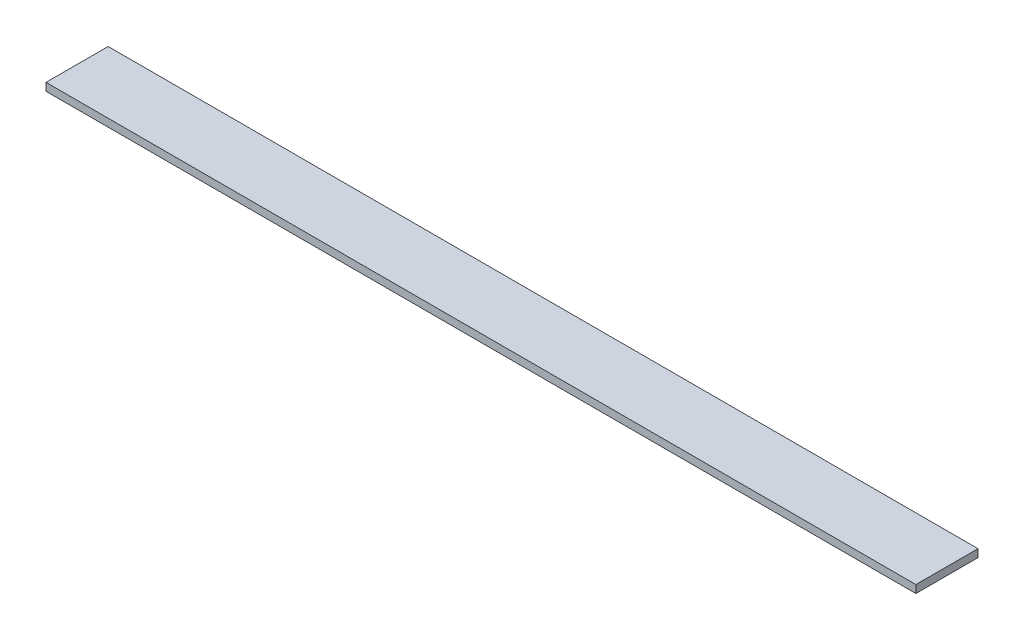
ISO-10303-21;
HEADER;
FILE_DESCRIPTION(('STEP AP214'),'2;1');
FILE_NAME('part.step','',(''),(''),'','','');
FILE_SCHEMA(('AUTOMOTIVE_DESIGN { 1 0 10303 214 1 1 1 1 }'));
ENDSEC;
DATA;
#1=APPLICATION_CONTEXT('core data for automotive mechanical design processes');
#2=APPLICATION_PROTOCOL_DEFINITION('international standard','automotive_design',2000,#1);
#3=PRODUCT_CONTEXT('',#1,'mechanical');
#4=PRODUCT('Part','Part','',(#3));
#5=PRODUCT_RELATED_PRODUCT_CATEGORY('part','',(#4));
#6=PRODUCT_DEFINITION_FORMATION('','',#4);
#7=PRODUCT_DEFINITION_CONTEXT('part definition',#1,'design');
#8=PRODUCT_DEFINITION('design','',#6,#7);
#9=PRODUCT_DEFINITION_SHAPE('','',#8);
#10=(LENGTH_UNIT() NAMED_UNIT(*) SI_UNIT(.MILLI.,.METRE.));
#11=(NAMED_UNIT(*) PLANE_ANGLE_UNIT() SI_UNIT($,.RADIAN.));
#12=(NAMED_UNIT(*) SI_UNIT($,.STERADIAN.) SOLID_ANGLE_UNIT());
#13=UNCERTAINTY_MEASURE_WITH_UNIT(LENGTH_MEASURE(1.E-05),#10,'distance_accuracy_value','');
#14=(GEOMETRIC_REPRESENTATION_CONTEXT(3) GLOBAL_UNCERTAINTY_ASSIGNED_CONTEXT((#13)) GLOBAL_UNIT_ASSIGNED_CONTEXT((#10,
#11,#12)) REPRESENTATION_CONTEXT('',''));
#15=CARTESIAN_POINT('',(0.,0.,0.));
#16=DIRECTION('',(0.,0.,1.));
#17=DIRECTION('',(1.,0.,0.));
#18=AXIS2_PLACEMENT_3D('',#15,#16,#17);
#19=CARTESIAN_POINT('',(-51.0353270365557,3.175,-21.6513508639933));
#20=DIRECTION('',(1.,0.,0.));
#21=DIRECTION('',(0.,0.,-1.));
#22=AXIS2_PLACEMENT_3D('',#19,#20,#21);
#23=PLANE('',#22);
#24=DIRECTION('',(0.,0.,1.));
#25=VECTOR('',#24,1.);
#26=CARTESIAN_POINT('',(-51.0353270365557,0.,-21.6513508639933));
#27=LINE('',#26,#25);
#28=CARTESIAN_POINT('',(-51.0353270365557,0.,-21.6513508639933));
#29=VERTEX_POINT('',#28);
#30=CARTESIAN_POINT('',(-51.0353270365557,0.,3.74864913600666));
#31=VERTEX_POINT('',#30);
#32=EDGE_CURVE('E107',#29,#31,#27,.T.);
#33=ORIENTED_EDGE('',*,*,#32,.T.);
#34=DIRECTION('',(0.,-1.,0.));
#35=VECTOR('',#34,1.);
#36=CARTESIAN_POINT('',(-51.0353270365557,3.175,3.74864913600666));
#37=LINE('',#36,#35);
#38=CARTESIAN_POINT('',(-51.0353270365557,3.175,3.74864913600666));
#39=VERTEX_POINT('',#38);
#40=EDGE_CURVE('E11',#39,#31,#37,.T.);
#41=ORIENTED_EDGE('',*,*,#40,.F.);
#42=DIRECTION('',(0.,0.,1.));
#43=VECTOR('',#42,1.);
#44=CARTESIAN_POINT('',(-51.0353270365557,3.175,-21.6513508639933));
#45=LINE('',#44,#43);
#46=CARTESIAN_POINT('',(-51.0353270365557,3.175,-21.6513508639933));
#47=VERTEX_POINT('',#46);
#48=EDGE_CURVE('E89',#47,#39,#45,.T.);
#49=ORIENTED_EDGE('',*,*,#48,.F.);
#50=DIRECTION('',(0.,-1.,0.));
#51=VECTOR('',#50,1.);
#52=CARTESIAN_POINT('',(-51.0353270365557,3.175,-21.6513508639933));
#53=LINE('',#52,#51);
#54=EDGE_CURVE('E56',#47,#29,#53,.T.);
#55=ORIENTED_EDGE('',*,*,#54,.T.);
#56=EDGE_LOOP('',(#33,#41,#49,#55));
#57=FACE_BOUND('',#56,.T.);
#58=ADVANCED_FACE('F39',(#57),#23,.F.);
#59=CARTESIAN_POINT('',(-51.0353270365557,3.175,3.74864913600666));
#60=DIRECTION('',(0.,0.,-1.));
#61=DIRECTION('',(-1.,0.,0.));
#62=AXIS2_PLACEMENT_3D('',#59,#60,#61);
#63=PLANE('',#62);
#64=DIRECTION('',(1.,0.,0.));
#65=VECTOR('',#64,1.);
#66=CARTESIAN_POINT('',(-51.0353270365557,0.,3.74864913600666));
#67=LINE('',#66,#65);
#68=CARTESIAN_POINT('',(304.564672963444,0.,3.74864913600666));
#69=VERTEX_POINT('',#68);
#70=EDGE_CURVE('E95',#31,#69,#67,.T.);
#71=ORIENTED_EDGE('',*,*,#70,.T.);
#72=DIRECTION('',(0.,-1.,0.));
#73=VECTOR('',#72,1.);
#74=CARTESIAN_POINT('',(304.564672963444,3.175,3.74864913600666));
#75=LINE('',#74,#73);
#76=CARTESIAN_POINT('',(304.564672963444,3.175,3.74864913600666));
#77=VERTEX_POINT('',#76);
#78=EDGE_CURVE('E48',#77,#69,#75,.T.);
#79=ORIENTED_EDGE('',*,*,#78,.F.);
#80=DIRECTION('',(1.,0.,0.));
#81=VECTOR('',#80,1.);
#82=CARTESIAN_POINT('',(-51.0353270365557,3.175,3.74864913600666));
#83=LINE('',#82,#81);
#84=EDGE_CURVE('E81',#39,#77,#83,.T.);
#85=ORIENTED_EDGE('',*,*,#84,.F.);
#86=ORIENTED_EDGE('',*,*,#40,.T.);
#87=EDGE_LOOP('',(#71,#79,#85,#86));
#88=FACE_BOUND('',#87,.T.);
#89=ADVANCED_FACE('F94',(#88),#63,.F.);
#90=CARTESIAN_POINT('',(304.564672963444,3.175,-21.6513508639933));
#91=DIRECTION('',(1.,0.,0.));
#92=DIRECTION('',(0.,0.,-1.));
#93=AXIS2_PLACEMENT_3D('',#90,#91,#92);
#94=PLANE('',#93);
#95=DIRECTION('',(0.,0.,1.));
#96=VECTOR('',#95,1.);
#97=CARTESIAN_POINT('',(304.564672963444,0.,-21.6513508639933));
#98=LINE('',#97,#96);
#99=CARTESIAN_POINT('',(304.564672963444,0.,-21.6513508639933));
#100=VERTEX_POINT('',#99);
#101=EDGE_CURVE('E112',#100,#69,#98,.T.);
#102=ORIENTED_EDGE('',*,*,#101,.F.);
#103=DIRECTION('',(0.,-1.,0.));
#104=VECTOR('',#103,1.);
#105=CARTESIAN_POINT('',(304.564672963444,3.175,-21.6513508639933));
#106=LINE('',#105,#104);
#107=CARTESIAN_POINT('',(304.564672963444,3.175,-21.6513508639933));
#108=VERTEX_POINT('',#107);
#109=EDGE_CURVE('E70',#108,#100,#106,.T.);
#110=ORIENTED_EDGE('',*,*,#109,.F.);
#111=DIRECTION('',(0.,0.,1.));
#112=VECTOR('',#111,1.);
#113=CARTESIAN_POINT('',(304.564672963444,3.175,-21.6513508639933));
#114=LINE('',#113,#112);
#115=EDGE_CURVE('E88',#108,#77,#114,.T.);
#116=ORIENTED_EDGE('',*,*,#115,.T.);
#117=ORIENTED_EDGE('',*,*,#78,.T.);
#118=EDGE_LOOP('',(#102,#110,#116,#117));
#119=FACE_BOUND('',#118,.T.);
#120=ADVANCED_FACE('F99',(#119),#94,.T.);
#121=CARTESIAN_POINT('',(-51.0353270365557,3.175,-21.6513508639933));
#122=DIRECTION('',(0.,0.,-1.));
#123=DIRECTION('',(-1.,0.,0.));
#124=AXIS2_PLACEMENT_3D('',#121,#122,#123);
#125=PLANE('',#124);
#126=DIRECTION('',(1.,0.,0.));
#127=VECTOR('',#126,1.);
#128=CARTESIAN_POINT('',(-51.0353270365557,0.,-21.6513508639933));
#129=LINE('',#128,#127);
#130=EDGE_CURVE('E115',#29,#100,#129,.T.);
#131=ORIENTED_EDGE('',*,*,#130,.F.);
#132=ORIENTED_EDGE('',*,*,#54,.F.);
#133=DIRECTION('',(1.,0.,0.));
#134=VECTOR('',#133,1.);
#135=CARTESIAN_POINT('',(-51.0353270365557,3.175,-21.6513508639933));
#136=LINE('',#135,#134);
#137=EDGE_CURVE('E101',#47,#108,#136,.T.);
#138=ORIENTED_EDGE('',*,*,#137,.T.);
#139=ORIENTED_EDGE('',*,*,#109,.T.);
#140=EDGE_LOOP('',(#131,#132,#138,#139));
#141=FACE_BOUND('',#140,.T.);
#142=ADVANCED_FACE('F125',(#141),#125,.T.);
#143=CARTESIAN_POINT('',(0.,3.175,0.));
#144=DIRECTION('',(0.,1.,0.));
#145=DIRECTION('',(0.,0.,1.));
#146=AXIS2_PLACEMENT_3D('',#143,#144,#145);
#147=PLANE('',#146);
#148=ORIENTED_EDGE('',*,*,#48,.T.);
#149=ORIENTED_EDGE('',*,*,#84,.T.);
#150=ORIENTED_EDGE('',*,*,#115,.F.);
#151=ORIENTED_EDGE('',*,*,#137,.F.);
#152=EDGE_LOOP('',(#148,#149,#150,#151));
#153=FACE_BOUND('',#152,.T.);
#154=ADVANCED_FACE('F85',(#153),#147,.T.);
#155=CARTESIAN_POINT('',(0.,0.,0.));
#156=DIRECTION('',(0.,1.,0.));
#157=DIRECTION('',(0.,0.,1.));
#158=AXIS2_PLACEMENT_3D('',#155,#156,#157);
#159=PLANE('',#158);
#160=ORIENTED_EDGE('',*,*,#32,.F.);
#161=ORIENTED_EDGE('',*,*,#130,.T.);
#162=ORIENTED_EDGE('',*,*,#101,.T.);
#163=ORIENTED_EDGE('',*,*,#70,.F.);
#164=EDGE_LOOP('',(#160,#161,#162,#163));
#165=FACE_BOUND('',#164,.T.);
#166=ADVANCED_FACE('F124',(#165),#159,.F.);
#167=CLOSED_SHELL('',(#58,#89,#120,#142,#154,#166));
#168=MANIFOLD_SOLID_BREP('B2',#167);
#169=ADVANCED_BREP_SHAPE_REPRESENTATION('',(#18,#168),#14);
#170=SHAPE_DEFINITION_REPRESENTATION(#9,#169);
ENDSEC;
END-ISO-10303-21;
